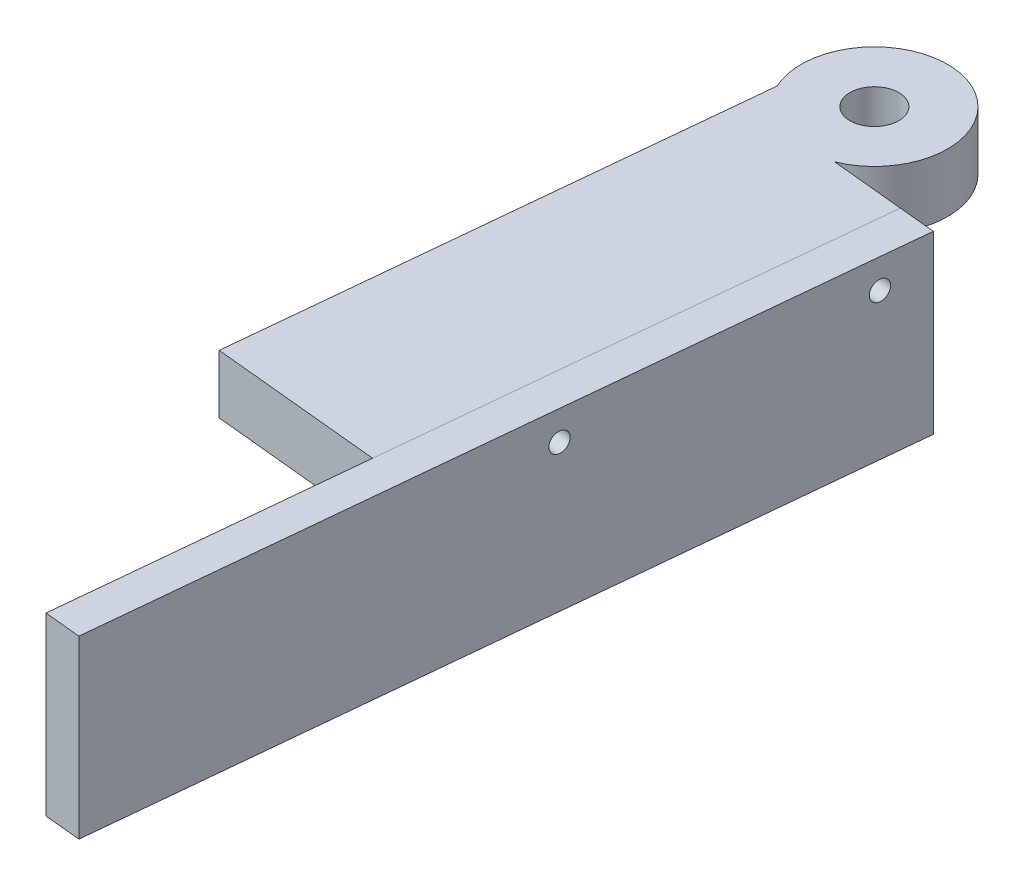
ISO-10303-21;
HEADER;
FILE_DESCRIPTION(('STEP AP214'),'2;1');
FILE_NAME('part.step','',(''),(''),'','','');
FILE_SCHEMA(('AUTOMOTIVE_DESIGN { 1 0 10303 214 1 1 1 1 }'));
ENDSEC;
DATA;
#1=APPLICATION_CONTEXT('core data for automotive mechanical design processes');
#2=APPLICATION_PROTOCOL_DEFINITION('international standard','automotive_design',2000,#1);
#3=PRODUCT_CONTEXT('',#1,'mechanical');
#4=PRODUCT('Part','Part','',(#3));
#5=PRODUCT_RELATED_PRODUCT_CATEGORY('part','',(#4));
#6=PRODUCT_DEFINITION_FORMATION('','',#4);
#7=PRODUCT_DEFINITION_CONTEXT('part definition',#1,'design');
#8=PRODUCT_DEFINITION('design','',#6,#7);
#9=PRODUCT_DEFINITION_SHAPE('','',#8);
#10=(LENGTH_UNIT() NAMED_UNIT(*) SI_UNIT(.MILLI.,.METRE.));
#11=(NAMED_UNIT(*) PLANE_ANGLE_UNIT() SI_UNIT($,.RADIAN.));
#12=(NAMED_UNIT(*) SI_UNIT($,.STERADIAN.) SOLID_ANGLE_UNIT());
#13=UNCERTAINTY_MEASURE_WITH_UNIT(LENGTH_MEASURE(1.E-05),#10,'distance_accuracy_value','');
#14=(GEOMETRIC_REPRESENTATION_CONTEXT(3) GLOBAL_UNCERTAINTY_ASSIGNED_CONTEXT((#13)) GLOBAL_UNIT_ASSIGNED_CONTEXT((#10,
#11,#12)) REPRESENTATION_CONTEXT('',''));
#15=CARTESIAN_POINT('',(0.,0.,0.));
#16=DIRECTION('',(0.,0.,1.));
#17=DIRECTION('',(1.,0.,0.));
#18=AXIS2_PLACEMENT_3D('',#15,#16,#17);
#19=CARTESIAN_POINT('',(17.8634223588954,2.54,10.2010701501113));
#20=DIRECTION('',(-0.098057802090348,0.,0.995180720999563));
#21=DIRECTION('',(0.995180720999563,0.,0.098057802090348));
#22=AXIS2_PLACEMENT_3D('',#19,#20,#21);
#23=PLANE('',#22);
#24=DIRECTION('',(0.,1.,0.));
#25=VECTOR('',#24,1.);
#26=CARTESIAN_POINT('',(13.123874175135,2.54,9.73406986765607));
#27=LINE('',#26,#25);
#28=CARTESIAN_POINT('',(13.123874175135,2.54,9.73406986765607));
#29=VERTEX_POINT('',#28);
#30=CARTESIAN_POINT('',(13.123874175135,25.4,9.73406986765607));
#31=VERTEX_POINT('',#30);
#32=EDGE_CURVE('P0_E92',#29,#31,#27,.T.);
#33=ORIENTED_EDGE('',*,*,#32,.T.);
#34=DIRECTION('',(-0.995180720999563,0.,-0.098057802090348));
#35=VECTOR('',#34,1.);
#36=CARTESIAN_POINT('',(17.8634223588954,25.4,10.2010701501113));
#37=LINE('',#36,#35);
#38=CARTESIAN_POINT('',(17.8634223588954,25.4,10.2010701501113));
#39=VERTEX_POINT('',#38);
#40=EDGE_CURVE('P0_E11',#39,#31,#37,.T.);
#41=ORIENTED_EDGE('',*,*,#40,.F.);
#42=DIRECTION('',(0.,1.,0.));
#43=VECTOR('',#42,1.);
#44=CARTESIAN_POINT('',(17.8634223588954,2.54,10.2010701501113));
#45=LINE('',#44,#43);
#46=CARTESIAN_POINT('',(17.8634223588954,2.54,10.2010701501113));
#47=VERTEX_POINT('',#46);
#48=EDGE_CURVE('P0_E86',#47,#39,#45,.T.);
#49=ORIENTED_EDGE('',*,*,#48,.F.);
#50=DIRECTION('',(-0.995180720999563,0.,-0.098057802090348));
#51=VECTOR('',#50,1.);
#52=CARTESIAN_POINT('',(17.8634223588954,2.54,10.2010701501113));
#53=LINE('',#52,#51);
#54=EDGE_CURVE('P0_E47',#47,#29,#53,.T.);
#55=ORIENTED_EDGE('',*,*,#54,.T.);
#56=EDGE_LOOP('',(#33,#41,#49,#55));
#57=FACE_BOUND('',#56,.T.);
#58=ADVANCED_FACE('P0_F40',(#57),#23,.F.);
#59=CARTESIAN_POINT('',(-41.9126137953808,25.4,616.863237671445));
#60=DIRECTION('',(0.,-1.,0.));
#61=DIRECTION('',(-0.995180720999563,0.,-0.098057802090348));
#62=AXIS2_PLACEMENT_3D('',#59,#60,#61);
#63=PLANE('',#62);
#64=DIRECTION('',(-0.098057802090348,0.,0.995180720999563));
#65=VECTOR('',#64,1.);
#66=CARTESIAN_POINT('',(-46.6521619791412,25.4,616.39623738899));
#67=LINE('',#66,#65);
#68=CARTESIAN_POINT('',(3.16120148275559,25.4,110.844431121212));
#69=VERTEX_POINT('',#68);
#70=EDGE_CURVE('P0_E87',#31,#69,#67,.T.);
#71=ORIENTED_EDGE('',*,*,#70,.T.);
#72=DIRECTION('',(-0.995180720999563,0.,-0.098057802090348));
#73=VECTOR('',#72,1.);
#74=CARTESIAN_POINT('',(67.1020193546008,25.4,117.144689890368));
#75=LINE('',#74,#73);
#76=CARTESIAN_POINT('',(7.90074966651599,25.4,111.311431403667));
#77=VERTEX_POINT('',#76);
#78=EDGE_CURVE('P0_E54',#77,#69,#75,.T.);
#79=ORIENTED_EDGE('',*,*,#78,.F.);
#80=DIRECTION('',(-0.098057802090348,0.,0.995180720999563));
#81=VECTOR('',#80,1.);
#82=CARTESIAN_POINT('',(-41.9126137953808,25.4,616.863237671445));
#83=LINE('',#82,#81);
#84=EDGE_CURVE('P0_E104',#39,#77,#83,.T.);
#85=ORIENTED_EDGE('',*,*,#84,.F.);
#86=ORIENTED_EDGE('',*,*,#40,.T.);
#87=EDGE_LOOP('',(#71,#79,#85,#86));
#88=FACE_BOUND('',#87,.T.);
#89=ADVANCED_FACE('P0_F125',(#88),#63,.F.);
#90=CARTESIAN_POINT('',(-41.9126137953808,2.53999999999997,616.863237671445));
#91=DIRECTION('',(0.,1.,0.));
#92=DIRECTION('',(0.995180720999563,0.,0.098057802090348));
#93=AXIS2_PLACEMENT_3D('',#90,#91,#92);
#94=PLANE('',#93);
#95=DIRECTION('',(0.098057802090348,0.,-0.995180720999563));
#96=VECTOR('',#95,1.);
#97=CARTESIAN_POINT('',(-41.9126137953808,2.53999999999997,616.863237671445));
#98=LINE('',#97,#96);
#99=CARTESIAN_POINT('',(7.90074966651599,2.53999999999999,111.311431403667));
#100=VERTEX_POINT('',#99);
#101=EDGE_CURVE('P0_E63',#100,#47,#98,.T.);
#102=ORIENTED_EDGE('',*,*,#101,.F.);
#103=DIRECTION('',(-0.995180720999563,0.,-0.098057802090348));
#104=VECTOR('',#103,1.);
#105=CARTESIAN_POINT('',(67.1020193546008,2.53999999999999,117.144689890368));
#106=LINE('',#105,#104);
#107=CARTESIAN_POINT('',(3.16120148275561,2.53999999999999,110.844431121212));
#108=VERTEX_POINT('',#107);
#109=EDGE_CURVE('P0_E83',#100,#108,#106,.T.);
#110=ORIENTED_EDGE('',*,*,#109,.T.);
#111=DIRECTION('',(0.098057802090348,0.,-0.995180720999563));
#112=VECTOR('',#111,1.);
#113=CARTESIAN_POINT('',(-46.6521619791412,2.53999999999997,616.39623738899));
#114=LINE('',#113,#112);
#115=EDGE_CURVE('P0_E77',#108,#29,#114,.T.);
#116=ORIENTED_EDGE('',*,*,#115,.T.);
#117=ORIENTED_EDGE('',*,*,#54,.F.);
#118=EDGE_LOOP('',(#102,#110,#116,#117));
#119=FACE_BOUND('',#118,.T.);
#120=ADVANCED_FACE('P0_F79',(#119),#94,.F.);
#121=CARTESIAN_POINT('',(-12.0245957182427,13.97,313.532153910778));
#122=DIRECTION('',(-0.995180720999563,0.,-0.098057802090348));
#123=DIRECTION('',(-0.098057802090348,0.,0.995180720999563));
#124=AXIS2_PLACEMENT_3D('',#121,#122,#123);
#125=PLANE('',#124);
#126=CARTESIAN_POINT('',(13.5047530559794,21.59,54.4368531985419));
#127=DIRECTION('',(0.995180720999563,0.,0.098057802090348));
#128=DIRECTION('',(0.098057802090348,0.,-0.995180720999563));
#129=AXIS2_PLACEMENT_3D('',#126,#127,#128);
#130=CIRCLE('',#129,1.26999999999998);
#131=CARTESIAN_POINT('',(13.6292864646341,21.59,53.1729736828725));
#132=VERTEX_POINT('',#131);
#133=EDGE_CURVE('P0_E100',#132,#132,#130,.T.);
#134=ORIENTED_EDGE('',*,*,#133,.F.);
#135=EDGE_LOOP('',(#134));
#136=FACE_BOUND('',#135,.T.);
#137=CARTESIAN_POINT('',(17.2407553156217,21.59,16.5204677284586));
#138=DIRECTION('',(0.995180720999563,0.,0.098057802090348));
#139=DIRECTION('',(0.098057802090348,0.,-0.995180720999563));
#140=AXIS2_PLACEMENT_3D('',#137,#138,#139);
#141=CIRCLE('',#140,1.26999999999998);
#142=CARTESIAN_POINT('',(17.3652887242764,21.59,15.2565882127891));
#143=VERTEX_POINT('',#142);
#144=EDGE_CURVE('P0_E111',#143,#143,#141,.T.);
#145=ORIENTED_EDGE('',*,*,#144,.F.);
#146=EDGE_LOOP('',(#145));
#147=FACE_BOUND('',#146,.T.);
#148=ORIENTED_EDGE('',*,*,#84,.T.);
#149=DIRECTION('',(0.,-1.,0.));
#150=VECTOR('',#149,1.);
#151=CARTESIAN_POINT('',(7.90074966651601,13.9699999999996,111.311431403667));
#152=LINE('',#151,#150);
#153=EDGE_CURVE('P0_E112',#77,#100,#152,.T.);
#154=ORIENTED_EDGE('',*,*,#153,.T.);
#155=ORIENTED_EDGE('',*,*,#101,.T.);
#156=ORIENTED_EDGE('',*,*,#48,.T.);
#157=EDGE_LOOP('',(#148,#154,#155,#156));
#158=FACE_BOUND('',#157,.T.);
#159=ADVANCED_FACE('P0_F126',(#136,#147,#158),#125,.F.);
#160=CARTESIAN_POINT('',(-16.7641439020031,13.97,313.065153628323));
#161=DIRECTION('',(-0.995180720999563,0.,-0.098057802090348));
#162=DIRECTION('',(-0.098057802090348,0.,0.995180720999563));
#163=AXIS2_PLACEMENT_3D('',#160,#161,#162);
#164=PLANE('',#163);
#165=DIRECTION('',(0.,-1.,0.));
#166=VECTOR('',#165,1.);
#167=CARTESIAN_POINT('',(3.16120148275561,2.01728832676585E-13,110.844431121212));
#168=LINE('',#167,#166);
#169=EDGE_CURVE('P0_E119',#69,#108,#168,.T.);
#170=ORIENTED_EDGE('',*,*,#169,.F.);
#171=ORIENTED_EDGE('',*,*,#70,.F.);
#172=ORIENTED_EDGE('',*,*,#32,.F.);
#173=ORIENTED_EDGE('',*,*,#115,.F.);
#174=EDGE_LOOP('',(#170,#171,#172,#173));
#175=FACE_BOUND('',#174,.T.);
#176=CARTESIAN_POINT('',(8.76520487221899,21.59,53.9698529160866));
#177=DIRECTION('',(0.995180720999563,0.,0.098057802090348));
#178=DIRECTION('',(0.098057802090348,0.,-0.995180720999563));
#179=AXIS2_PLACEMENT_3D('',#176,#177,#178);
#180=CIRCLE('',#179,1.26999999999998);
#181=CARTESIAN_POINT('',(8.88973828087373,21.59,52.7059734004172));
#182=VERTEX_POINT('',#181);
#183=EDGE_CURVE('P0_E96',#182,#182,#180,.T.);
#184=ORIENTED_EDGE('',*,*,#183,.T.);
#185=EDGE_LOOP('',(#184));
#186=FACE_BOUND('',#185,.T.);
#187=CARTESIAN_POINT('',(12.5012071318612,21.59,16.0534674460033));
#188=DIRECTION('',(0.995180720999563,0.,0.098057802090348));
#189=DIRECTION('',(0.098057802090348,0.,-0.995180720999563));
#190=AXIS2_PLACEMENT_3D('',#187,#188,#189);
#191=CIRCLE('',#190,1.26999999999998);
#192=CARTESIAN_POINT('',(12.625740540516,21.59,14.7895879303339));
#193=VERTEX_POINT('',#192);
#194=EDGE_CURVE('P0_E108',#193,#193,#191,.T.);
#195=ORIENTED_EDGE('',*,*,#194,.T.);
#196=EDGE_LOOP('',(#195));
#197=FACE_BOUND('',#196,.T.);
#198=ADVANCED_FACE('P0_F93',(#175,#186,#197),#164,.T.);
#199=CARTESIAN_POINT('',(12.5012071318612,21.59,16.0534674460033));
#200=DIRECTION('',(0.995180720999563,0.,0.098057802090348));
#201=DIRECTION('',(0.098057802090348,0.,-0.995180720999563));
#202=AXIS2_PLACEMENT_3D('',#199,#200,#201);
#203=CYLINDRICAL_SURFACE('',#202,1.26999999999998);
#204=ORIENTED_EDGE('',*,*,#194,.F.);
#205=EDGE_LOOP('',(#204));
#206=FACE_BOUND('',#205,.T.);
#207=ORIENTED_EDGE('',*,*,#144,.T.);
#208=EDGE_LOOP('',(#207));
#209=FACE_BOUND('',#208,.T.);
#210=ADVANCED_FACE('P0_F134',(#206,#209),#203,.F.);
#211=CARTESIAN_POINT('',(8.76520487221899,21.59,53.9698529160866));
#212=DIRECTION('',(0.995180720999563,0.,0.098057802090348));
#213=DIRECTION('',(0.098057802090348,0.,-0.995180720999563));
#214=AXIS2_PLACEMENT_3D('',#211,#212,#213);
#215=CYLINDRICAL_SURFACE('',#214,1.26999999999998);
#216=ORIENTED_EDGE('',*,*,#183,.F.);
#217=EDGE_LOOP('',(#216));
#218=FACE_BOUND('',#217,.T.);
#219=ORIENTED_EDGE('',*,*,#133,.T.);
#220=EDGE_LOOP('',(#219));
#221=FACE_BOUND('',#220,.T.);
#222=ADVANCED_FACE('P0_F164',(#218,#221),#215,.F.);
#223=CARTESIAN_POINT('',(67.1020193546008,2.01728832546268E-13,117.144689890368));
#224=DIRECTION('',(0.098057802090348,0.,-0.995180720999563));
#225=DIRECTION('',(-0.995180720999563,0.,-0.0980578020903479));
#226=AXIS2_PLACEMENT_3D('',#223,#224,#225);
#227=PLANE('',#226);
#228=ORIENTED_EDGE('',*,*,#78,.T.);
#229=ORIENTED_EDGE('',*,*,#169,.T.);
#230=ORIENTED_EDGE('',*,*,#109,.F.);
#231=ORIENTED_EDGE('',*,*,#153,.F.);
#232=EDGE_LOOP('',(#228,#229,#230,#231));
#233=FACE_BOUND('',#232,.T.);
#234=ADVANCED_FACE('P0_F121',(#233),#227,.F.);
#235=CLOSED_SHELL('',(#58,#89,#120,#159,#198,#210,#222,#234));
#236=MANIFOLD_SOLID_BREP('P0_B2',#235);
#237=CARTESIAN_POINT('',(-8.17030627603128,17.78,-0.805041997827207));
#238=DIRECTION('',(0.995180720999563,0.,0.098057802090348));
#239=DIRECTION('',(-0.098057802090348,0.,0.995180720999563));
#240=AXIS2_PLACEMENT_3D('',#237,#238,#239);
#241=PLANE('',#240);
#242=DIRECTION('',(0.098057802090348,0.,-0.995180720999563));
#243=VECTOR('',#242,1.);
#244=CARTESIAN_POINT('',(-8.17030627603128,25.4,-0.805041997827207));
#245=LINE('',#244,#243);
#246=CARTESIAN_POINT('',(-15.1486023191254,25.4,70.0171214554818));
#247=VERTEX_POINT('',#246);
#248=CARTESIAN_POINT('',(-8.64387193883597,25.4,4.00113770132998));
#249=VERTEX_POINT('',#248);
#250=EDGE_CURVE('P1_E108',#247,#249,#245,.T.);
#251=ORIENTED_EDGE('',*,*,#250,.T.);
#252=DIRECTION('',(0.,1.,0.));
#253=VECTOR('',#252,1.);
#254=CARTESIAN_POINT('',(-8.64387193883597,17.78,4.00113770132998));
#255=LINE('',#254,#253);
#256=CARTESIAN_POINT('',(-8.64387193883597,17.78,4.00113770132998));
#257=VERTEX_POINT('',#256);
#258=EDGE_CURVE('P1_E11',#257,#249,#255,.T.);
#259=ORIENTED_EDGE('',*,*,#258,.F.);
#260=DIRECTION('',(0.098057802090348,0.,-0.995180720999563));
#261=VECTOR('',#260,1.);
#262=CARTESIAN_POINT('',(-8.17030627603128,17.78,-0.805041997827207));
#263=LINE('',#262,#261);
#264=CARTESIAN_POINT('',(-15.1486023191254,17.78,70.0171214554818));
#265=VERTEX_POINT('',#264);
#266=EDGE_CURVE('P1_E110',#265,#257,#263,.T.);
#267=ORIENTED_EDGE('',*,*,#266,.F.);
#268=DIRECTION('',(0.,1.,0.));
#269=VECTOR('',#268,1.);
#270=CARTESIAN_POINT('',(-15.1486023191254,17.78,70.0171214554818));
#271=LINE('',#270,#269);
#272=EDGE_CURVE('P1_E122',#265,#247,#271,.T.);
#273=ORIENTED_EDGE('',*,*,#272,.T.);
#274=EDGE_LOOP('',(#251,#259,#267,#273));
#275=FACE_BOUND('',#274,.T.);
#276=ADVANCED_FACE('P1_F16',(#275),#241,.F.);
#277=CARTESIAN_POINT('',(0.,17.78,0.));
#278=DIRECTION('',(0.,1.,0.));
#279=DIRECTION('',(0.0980578020903479,0.,-0.995180720999563));
#280=AXIS2_PLACEMENT_3D('',#277,#278,#279);
#281=CYLINDRICAL_SURFACE('',#280,9.525);
#282=CARTESIAN_POINT('',(0.,25.4,0.));
#283=DIRECTION('',(0.,-1.,0.));
#284=DIRECTION('',(-0.0980578020903479,0.,0.995180720999563));
#285=AXIS2_PLACEMENT_3D('',#282,#283,#284);
#286=CIRCLE('',#285,9.525);
#287=CARTESIAN_POINT('',(3.64477780761411,25.4,8.8000693027455));
#288=VERTEX_POINT('',#287);
#289=EDGE_CURVE('P1_E47',#249,#288,#286,.T.);
#290=ORIENTED_EDGE('',*,*,#289,.T.);
#291=DIRECTION('',(0.,1.,0.));
#292=VECTOR('',#291,1.);
#293=CARTESIAN_POINT('',(3.64477780761411,17.78,8.8000693027455));
#294=LINE('',#293,#292);
#295=CARTESIAN_POINT('',(3.64477780761411,17.78,8.8000693027455));
#296=VERTEX_POINT('',#295);
#297=EDGE_CURVE('P1_E25',#296,#288,#294,.T.);
#298=ORIENTED_EDGE('',*,*,#297,.F.);
#299=CARTESIAN_POINT('',(0.,17.78,0.));
#300=DIRECTION('',(0.,-1.,0.));
#301=DIRECTION('',(-0.0980578020903479,0.,0.995180720999563));
#302=AXIS2_PLACEMENT_3D('',#299,#300,#301);
#303=CIRCLE('',#302,9.525);
#304=EDGE_CURVE('P1_E56',#257,#296,#303,.T.);
#305=ORIENTED_EDGE('',*,*,#304,.F.);
#306=ORIENTED_EDGE('',*,*,#258,.T.);
#307=EDGE_LOOP('',(#290,#298,#305,#306));
#308=FACE_BOUND('',#307,.T.);
#309=ADVANCED_FACE('P1_F140',(#308),#281,.T.);
#310=CARTESIAN_POINT('',(-6.97829604309416,17.78,70.822163453309));
#311=DIRECTION('',(0.0980578020903479,0.,-0.995180720999563));
#312=DIRECTION('',(0.995180720999563,0.,0.0980578020903479));
#313=AXIS2_PLACEMENT_3D('',#310,#311,#312);
#314=PLANE('',#313);
#315=DIRECTION('',(-0.995180720999563,0.,-0.0980578020903479));
#316=VECTOR('',#315,1.);
#317=CARTESIAN_POINT('',(-6.97829604309416,25.4,70.822163453309));
#318=LINE('',#317,#316);
#319=CARTESIAN_POINT('',(6.96928920508984,25.4,72.1964561069398));
#320=VERTEX_POINT('',#319);
#321=EDGE_CURVE('P1_E53',#320,#247,#318,.T.);
#322=ORIENTED_EDGE('',*,*,#321,.T.);
#323=ORIENTED_EDGE('',*,*,#272,.F.);
#324=DIRECTION('',(-0.995180720999563,0.,-0.0980578020903479));
#325=VECTOR('',#324,1.);
#326=CARTESIAN_POINT('',(-6.97829604309416,17.78,70.822163453309));
#327=LINE('',#326,#325);
#328=CARTESIAN_POINT('',(6.96928920508984,17.78,72.1964561069398));
#329=VERTEX_POINT('',#328);
#330=EDGE_CURVE('P1_E33',#329,#265,#327,.T.);
#331=ORIENTED_EDGE('',*,*,#330,.F.);
#332=DIRECTION('',(0.,-1.,0.));
#333=VECTOR('',#332,1.);
#334=CARTESIAN_POINT('',(6.96928920508984,25.4,72.1964561069398));
#335=LINE('',#334,#333);
#336=EDGE_CURVE('P1_E79',#320,#329,#335,.T.);
#337=ORIENTED_EDGE('',*,*,#336,.F.);
#338=EDGE_LOOP('',(#322,#323,#331,#337));
#339=FACE_BOUND('',#338,.T.);
#340=ADVANCED_FACE('P1_F142',(#339),#314,.F.);
#341=CARTESIAN_POINT('',(0.,17.78,0.));
#342=DIRECTION('',(0.,1.,0.));
#343=DIRECTION('',(0.0980578020903479,0.,-0.995180720999563));
#344=AXIS2_PLACEMENT_3D('',#341,#342,#343);
#345=CYLINDRICAL_SURFACE('',#344,3.175);
#346=CARTESIAN_POINT('',(0.,17.78,0.));
#347=DIRECTION('',(0.,-1.,0.));
#348=DIRECTION('',(-0.0980578020903479,0.,0.995180720999563));
#349=AXIS2_PLACEMENT_3D('',#346,#347,#348);
#350=CIRCLE('',#349,3.175);
#351=CARTESIAN_POINT('',(-0.311333521636854,17.78,3.15969878917361));
#352=VERTEX_POINT('',#351);
#353=EDGE_CURVE('P1_E118',#352,#352,#350,.T.);
#354=ORIENTED_EDGE('',*,*,#353,.T.);
#355=EDGE_LOOP('',(#354));
#356=FACE_BOUND('',#355,.T.);
#357=CARTESIAN_POINT('',(0.,25.4,0.));
#358=DIRECTION('',(0.,-1.,0.));
#359=DIRECTION('',(-0.0980578020903479,0.,0.995180720999563));
#360=AXIS2_PLACEMENT_3D('',#357,#358,#359);
#361=CIRCLE('',#360,3.175);
#362=CARTESIAN_POINT('',(-0.311333521636854,25.4,3.15969878917361));
#363=VERTEX_POINT('',#362);
#364=EDGE_CURVE('P1_E113',#363,#363,#361,.T.);
#365=ORIENTED_EDGE('',*,*,#364,.F.);
#366=EDGE_LOOP('',(#365));
#367=FACE_BOUND('',#366,.T.);
#368=ADVANCED_FACE('P1_F148',(#356,#367),#345,.F.);
#369=CARTESIAN_POINT('',(0.,17.78,0.));
#370=DIRECTION('',(0.,-1.,0.));
#371=DIRECTION('',(-0.0980578020903479,0.,0.995180720999563));
#372=AXIS2_PLACEMENT_3D('',#369,#370,#371);
#373=PLANE('',#372);
#374=ORIENTED_EDGE('',*,*,#266,.T.);
#375=ORIENTED_EDGE('',*,*,#304,.T.);
#376=DIRECTION('',(-0.995180720999563,0.,-0.0980578020903481));
#377=VECTOR('',#376,1.);
#378=CARTESIAN_POINT('',(13.1238741751349,17.78,9.73406986765606));
#379=LINE('',#378,#377);
#380=CARTESIAN_POINT('',(13.1238741751349,17.78,9.73406986765606));
#381=VERTEX_POINT('',#380);
#382=EDGE_CURVE('P1_E95',#381,#296,#379,.T.);
#383=ORIENTED_EDGE('',*,*,#382,.F.);
#384=DIRECTION('',(0.0980578020903481,0.,-0.995180720999563));
#385=VECTOR('',#384,1.);
#386=CARTESIAN_POINT('',(6.96928920508984,17.78,72.1964561069398));
#387=LINE('',#386,#385);
#388=EDGE_CURVE('P1_E85',#329,#381,#387,.T.);
#389=ORIENTED_EDGE('',*,*,#388,.F.);
#390=ORIENTED_EDGE('',*,*,#330,.T.);
#391=EDGE_LOOP('',(#374,#375,#383,#389,#390));
#392=FACE_BOUND('',#391,.T.);
#393=ORIENTED_EDGE('',*,*,#353,.F.);
#394=EDGE_LOOP('',(#393));
#395=FACE_BOUND('',#394,.T.);
#396=ADVANCED_FACE('P1_F153',(#392,#395),#373,.T.);
#397=CARTESIAN_POINT('',(0.,25.4,0.));
#398=DIRECTION('',(0.,-1.,0.));
#399=DIRECTION('',(-0.0980578020903479,0.,0.995180720999563));
#400=AXIS2_PLACEMENT_3D('',#397,#398,#399);
#401=PLANE('',#400);
#402=ORIENTED_EDGE('',*,*,#250,.F.);
#403=ORIENTED_EDGE('',*,*,#321,.F.);
#404=DIRECTION('',(-0.0980578020903481,0.,0.995180720999563));
#405=VECTOR('',#404,1.);
#406=CARTESIAN_POINT('',(13.1238741751349,25.4,9.73406986765606));
#407=LINE('',#406,#405);
#408=CARTESIAN_POINT('',(13.1238741751349,25.4,9.73406986765606));
#409=VERTEX_POINT('',#408);
#410=EDGE_CURVE('P1_E68',#409,#320,#407,.T.);
#411=ORIENTED_EDGE('',*,*,#410,.F.);
#412=DIRECTION('',(-0.995180720999563,0.,-0.0980578020903481));
#413=VECTOR('',#412,1.);
#414=CARTESIAN_POINT('',(13.1238741751349,25.4,9.73406986765606));
#415=LINE('',#414,#413);
#416=EDGE_CURVE('P1_E74',#409,#288,#415,.T.);
#417=ORIENTED_EDGE('',*,*,#416,.T.);
#418=ORIENTED_EDGE('',*,*,#289,.F.);
#419=EDGE_LOOP('',(#402,#403,#411,#417,#418));
#420=FACE_BOUND('',#419,.T.);
#421=ORIENTED_EDGE('',*,*,#364,.T.);
#422=EDGE_LOOP('',(#421));
#423=FACE_BOUND('',#422,.T.);
#424=ADVANCED_FACE('P1_F71',(#420,#423),#401,.F.);
#425=CARTESIAN_POINT('',(13.947585248184,25.4,1.37429265363078));
#426=DIRECTION('',(0.995180720999563,0.,0.0980578020903481));
#427=DIRECTION('',(-0.0980578020903481,0.,0.995180720999563));
#428=AXIS2_PLACEMENT_3D('',#425,#426,#427);
#429=PLANE('',#428);
#430=CARTESIAN_POINT('',(8.76520487221898,21.59,53.9698529160866));
#431=DIRECTION('',(0.995180720999563,0.,0.0980578020903481));
#432=DIRECTION('',(-0.0980578020903481,0.,0.995180720999563));
#433=AXIS2_PLACEMENT_3D('',#430,#431,#432);
#434=CIRCLE('',#433,2.54);
#435=CARTESIAN_POINT('',(8.51613805490949,21.59,56.4976119474255));
#436=VERTEX_POINT('',#435);
#437=EDGE_CURVE('P1_E90',#436,#436,#434,.T.);
#438=ORIENTED_EDGE('',*,*,#437,.F.);
#439=EDGE_LOOP('',(#438));
#440=FACE_BOUND('',#439,.T.);
#441=DIRECTION('',(0.,1.,0.));
#442=VECTOR('',#441,1.);
#443=CARTESIAN_POINT('',(13.1238741751349,17.78,9.73406986765606));
#444=LINE('',#443,#442);
#445=EDGE_CURVE('P1_E80',#381,#409,#444,.T.);
#446=ORIENTED_EDGE('',*,*,#445,.T.);
#447=ORIENTED_EDGE('',*,*,#410,.T.);
#448=ORIENTED_EDGE('',*,*,#336,.T.);
#449=ORIENTED_EDGE('',*,*,#388,.T.);
#450=EDGE_LOOP('',(#446,#447,#448,#449));
#451=FACE_BOUND('',#450,.T.);
#452=CARTESIAN_POINT('',(12.5012071318612,21.59,16.0534674460033));
#453=DIRECTION('',(0.995180720999563,0.,0.0980578020903481));
#454=DIRECTION('',(-0.0980578020903481,0.,0.995180720999563));
#455=AXIS2_PLACEMENT_3D('',#452,#453,#454);
#456=CIRCLE('',#455,2.54);
#457=CARTESIAN_POINT('',(12.2521403145518,21.59,18.5812264773422));
#458=VERTEX_POINT('',#457);
#459=EDGE_CURVE('P1_E185',#458,#458,#456,.T.);
#460=ORIENTED_EDGE('',*,*,#459,.F.);
#461=EDGE_LOOP('',(#460));
#462=FACE_BOUND('',#461,.T.);
#463=ADVANCED_FACE('P1_F83',(#440,#451,#462),#429,.T.);
#464=CARTESIAN_POINT('',(13.1238741751349,17.78,9.73406986765606));
#465=DIRECTION('',(-0.0980578020903481,0.,0.995180720999563));
#466=DIRECTION('',(-0.995180720999563,0.,-0.0980578020903481));
#467=AXIS2_PLACEMENT_3D('',#464,#465,#466);
#468=PLANE('',#467);
#469=ORIENTED_EDGE('',*,*,#297,.T.);
#470=ORIENTED_EDGE('',*,*,#416,.F.);
#471=ORIENTED_EDGE('',*,*,#445,.F.);
#472=ORIENTED_EDGE('',*,*,#382,.T.);
#473=EDGE_LOOP('',(#469,#470,#471,#472));
#474=FACE_BOUND('',#473,.T.);
#475=ADVANCED_FACE('P1_F92',(#474),#468,.F.);
#476=CARTESIAN_POINT('',(-7.03328907364908,21.59,52.4131853079024));
#477=DIRECTION('',(0.995180720999563,0.,0.098057802090348));
#478=DIRECTION('',(-0.098057802090348,0.,0.995180720999563));
#479=AXIS2_PLACEMENT_3D('',#476,#477,#478);
#480=PLANE('',#479);
#481=CARTESIAN_POINT('',(-7.03328907364908,21.59,52.4131853079024));
#482=DIRECTION('',(0.995180720999563,0.,0.098057802090348));
#483=DIRECTION('',(-0.098057802090348,0.,0.995180720999563));
#484=AXIS2_PLACEMENT_3D('',#481,#482,#483);
#485=CIRCLE('',#484,2.54);
#486=CARTESIAN_POINT('',(-7.28235589095856,21.59,54.9409443392413));
#487=VERTEX_POINT('',#486);
#488=EDGE_CURVE('P1_E94',#487,#487,#485,.T.);
#489=ORIENTED_EDGE('',*,*,#488,.T.);
#490=EDGE_LOOP('',(#489));
#491=FACE_BOUND('',#490,.T.);
#492=ADVANCED_FACE('P1_F159',(#491),#480,.T.);
#493=CARTESIAN_POINT('',(-7.03328907364908,21.59,52.4131853079024));
#494=DIRECTION('',(0.995180720999563,0.,0.098057802090348));
#495=DIRECTION('',(-0.098057802090348,0.,0.995180720999563));
#496=AXIS2_PLACEMENT_3D('',#493,#494,#495);
#497=CYLINDRICAL_SURFACE('',#496,2.54);
#498=ORIENTED_EDGE('',*,*,#488,.F.);
#499=EDGE_LOOP('',(#498));
#500=FACE_BOUND('',#499,.T.);
#501=ORIENTED_EDGE('',*,*,#437,.T.);
#502=EDGE_LOOP('',(#501));
#503=FACE_BOUND('',#502,.T.);
#504=ADVANCED_FACE('P1_F162',(#500,#503),#497,.F.);
#505=CARTESIAN_POINT('',(-3.29728681400682,21.59,14.496799837819));
#506=DIRECTION('',(0.995180720999563,0.,0.098057802090348));
#507=DIRECTION('',(-0.098057802090348,0.,0.995180720999563));
#508=AXIS2_PLACEMENT_3D('',#505,#506,#507);
#509=PLANE('',#508);
#510=CARTESIAN_POINT('',(-3.29728681400682,21.59,14.496799837819));
#511=DIRECTION('',(0.995180720999563,0.,0.098057802090348));
#512=DIRECTION('',(-0.098057802090348,0.,0.995180720999563));
#513=AXIS2_PLACEMENT_3D('',#510,#511,#512);
#514=CIRCLE('',#513,2.54);
#515=CARTESIAN_POINT('',(-3.54635363131631,21.59,17.0245588691579));
#516=VERTEX_POINT('',#515);
#517=EDGE_CURVE('P1_E101',#516,#516,#514,.T.);
#518=ORIENTED_EDGE('',*,*,#517,.T.);
#519=EDGE_LOOP('',(#518));
#520=FACE_BOUND('',#519,.T.);
#521=ADVANCED_FACE('P1_F166',(#520),#509,.T.);
#522=CARTESIAN_POINT('',(-3.29728681400682,21.59,14.496799837819));
#523=DIRECTION('',(0.995180720999563,0.,0.098057802090348));
#524=DIRECTION('',(-0.098057802090348,0.,0.995180720999563));
#525=AXIS2_PLACEMENT_3D('',#522,#523,#524);
#526=CYLINDRICAL_SURFACE('',#525,2.54);
#527=ORIENTED_EDGE('',*,*,#517,.F.);
#528=EDGE_LOOP('',(#527));
#529=FACE_BOUND('',#528,.T.);
#530=ORIENTED_EDGE('',*,*,#459,.T.);
#531=EDGE_LOOP('',(#530));
#532=FACE_BOUND('',#531,.T.);
#533=ADVANCED_FACE('P1_F168',(#529,#532),#526,.F.);
#534=CLOSED_SHELL('',(#276,#309,#340,#368,#396,#424,#463,#475,#492,#504,#521,#533));
#535=MANIFOLD_SOLID_BREP('P1_B1',#534);
#536=ADVANCED_BREP_SHAPE_REPRESENTATION('',(#18,#236,#535),#14);
#537=SHAPE_DEFINITION_REPRESENTATION(#9,#536);
ENDSEC;
END-ISO-10303-21;
